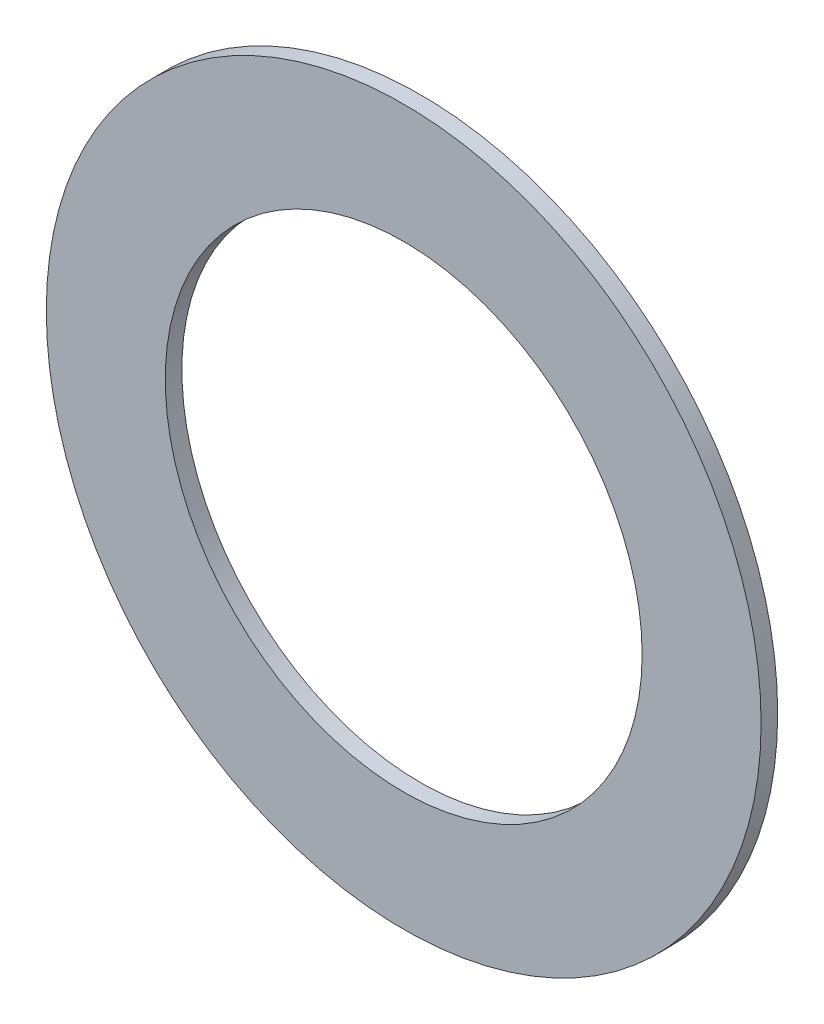
ISO-10303-21;
HEADER;
FILE_DESCRIPTION(('STEP AP214'),'2;1');
FILE_NAME('part.step','',(''),(''),'','','');
FILE_SCHEMA(('AUTOMOTIVE_DESIGN { 1 0 10303 214 1 1 1 1 }'));
ENDSEC;
DATA;
#1=APPLICATION_CONTEXT('core data for automotive mechanical design processes');
#2=APPLICATION_PROTOCOL_DEFINITION('international standard','automotive_design',2000,#1);
#3=PRODUCT_CONTEXT('',#1,'mechanical');
#4=PRODUCT('Part','Part','',(#3));
#5=PRODUCT_RELATED_PRODUCT_CATEGORY('part','',(#4));
#6=PRODUCT_DEFINITION_FORMATION('','',#4);
#7=PRODUCT_DEFINITION_CONTEXT('part definition',#1,'design');
#8=PRODUCT_DEFINITION('design','',#6,#7);
#9=PRODUCT_DEFINITION_SHAPE('','',#8);
#10=(LENGTH_UNIT() NAMED_UNIT(*) SI_UNIT(.MILLI.,.METRE.));
#11=(NAMED_UNIT(*) PLANE_ANGLE_UNIT() SI_UNIT($,.RADIAN.));
#12=(NAMED_UNIT(*) SI_UNIT($,.STERADIAN.) SOLID_ANGLE_UNIT());
#13=UNCERTAINTY_MEASURE_WITH_UNIT(LENGTH_MEASURE(1.E-05),#10,'distance_accuracy_value','');
#14=(GEOMETRIC_REPRESENTATION_CONTEXT(3) GLOBAL_UNCERTAINTY_ASSIGNED_CONTEXT((#13)) GLOBAL_UNIT_ASSIGNED_CONTEXT((#10,
#11,#12)) REPRESENTATION_CONTEXT('',''));
#15=CARTESIAN_POINT('',(0.,0.,0.));
#16=DIRECTION('',(0.,0.,1.));
#17=DIRECTION('',(1.,0.,0.));
#18=AXIS2_PLACEMENT_3D('',#15,#16,#17);
#19=CARTESIAN_POINT('',(164.79980395356,1350.51395299235,1.5875));
#20=DIRECTION('',(0.,0.,1.));
#21=DIRECTION('',(1.,0.,0.));
#22=AXIS2_PLACEMENT_3D('',#19,#20,#21);
#23=PLANE('',#22);
#24=CARTESIAN_POINT('',(164.79980395356,1350.51395299235,1.5875));
#25=DIRECTION('',(0.,0.,1.));
#26=DIRECTION('',(1.,0.,0.));
#27=AXIS2_PLACEMENT_3D('',#24,#25,#26);
#28=CIRCLE('',#27,34.1884000000001);
#29=CARTESIAN_POINT('',(198.98820395356,1350.51395299235,1.5875));
#30=VERTEX_POINT('',#29);
#31=EDGE_CURVE('E10',#30,#30,#28,.T.);
#32=ORIENTED_EDGE('',*,*,#31,.T.);
#33=EDGE_LOOP('',(#32));
#34=FACE_BOUND('',#33,.T.);
#35=CARTESIAN_POINT('',(164.79980395356,1350.51395299235,1.5875));
#36=DIRECTION('',(0.,0.,1.));
#37=DIRECTION('',(1.,0.,0.));
#38=AXIS2_PLACEMENT_3D('',#35,#36,#37);
#39=CIRCLE('',#38,22.8092000000001);
#40=CARTESIAN_POINT('',(187.60900395356,1350.51395299235,1.5875));
#41=VERTEX_POINT('',#40);
#42=EDGE_CURVE('E45',#41,#41,#39,.T.);
#43=ORIENTED_EDGE('',*,*,#42,.F.);
#44=EDGE_LOOP('',(#43));
#45=FACE_BOUND('',#44,.T.);
#46=ADVANCED_FACE('F34',(#34,#45),#23,.T.);
#47=CARTESIAN_POINT('',(164.79980395356,1350.51395299235,0.));
#48=DIRECTION('',(0.,0.,1.));
#49=DIRECTION('',(1.,0.,0.));
#50=AXIS2_PLACEMENT_3D('',#47,#48,#49);
#51=PLANE('',#50);
#52=CARTESIAN_POINT('',(164.79980395356,1350.51395299235,0.));
#53=DIRECTION('',(0.,0.,1.));
#54=DIRECTION('',(1.,0.,0.));
#55=AXIS2_PLACEMENT_3D('',#52,#53,#54);
#56=CIRCLE('',#55,34.1884000000001);
#57=CARTESIAN_POINT('',(198.98820395356,1350.51395299235,0.));
#58=VERTEX_POINT('',#57);
#59=EDGE_CURVE('E38',#58,#58,#56,.T.);
#60=ORIENTED_EDGE('',*,*,#59,.F.);
#61=EDGE_LOOP('',(#60));
#62=FACE_BOUND('',#61,.T.);
#63=CARTESIAN_POINT('',(164.79980395356,1350.51395299235,0.));
#64=DIRECTION('',(0.,0.,1.));
#65=DIRECTION('',(1.,0.,0.));
#66=AXIS2_PLACEMENT_3D('',#63,#64,#65);
#67=CIRCLE('',#66,22.8092000000001);
#68=CARTESIAN_POINT('',(187.60900395356,1350.51395299235,0.));
#69=VERTEX_POINT('',#68);
#70=EDGE_CURVE('E47',#69,#69,#67,.T.);
#71=ORIENTED_EDGE('',*,*,#70,.T.);
#72=EDGE_LOOP('',(#71));
#73=FACE_BOUND('',#72,.T.);
#74=ADVANCED_FACE('F57',(#62,#73),#51,.F.);
#75=CARTESIAN_POINT('',(164.79980395356,1350.51395299235,1.5875));
#76=DIRECTION('',(0.,0.,-1.));
#77=DIRECTION('',(-1.,0.,0.));
#78=AXIS2_PLACEMENT_3D('',#75,#76,#77);
#79=CYLINDRICAL_SURFACE('',#78,34.1884000000001);
#80=ORIENTED_EDGE('',*,*,#31,.F.);
#81=EDGE_LOOP('',(#80));
#82=FACE_BOUND('',#81,.T.);
#83=ORIENTED_EDGE('',*,*,#59,.T.);
#84=EDGE_LOOP('',(#83));
#85=FACE_BOUND('',#84,.T.);
#86=ADVANCED_FACE('F36',(#82,#85),#79,.T.);
#87=CARTESIAN_POINT('',(164.79980395356,1350.51395299235,1.5875));
#88=DIRECTION('',(0.,0.,-1.));
#89=DIRECTION('',(-1.,0.,0.));
#90=AXIS2_PLACEMENT_3D('',#87,#88,#89);
#91=CYLINDRICAL_SURFACE('',#90,22.8092000000001);
#92=ORIENTED_EDGE('',*,*,#42,.T.);
#93=EDGE_LOOP('',(#92));
#94=FACE_BOUND('',#93,.T.);
#95=ORIENTED_EDGE('',*,*,#70,.F.);
#96=EDGE_LOOP('',(#95));
#97=FACE_BOUND('',#96,.T.);
#98=ADVANCED_FACE('F53',(#94,#97),#91,.F.);
#99=CLOSED_SHELL('',(#46,#74,#86,#98));
#100=MANIFOLD_SOLID_BREP('B2',#99);
#101=ADVANCED_BREP_SHAPE_REPRESENTATION('',(#18,#100),#14);
#102=SHAPE_DEFINITION_REPRESENTATION(#9,#101);
ENDSEC;
END-ISO-10303-21;
